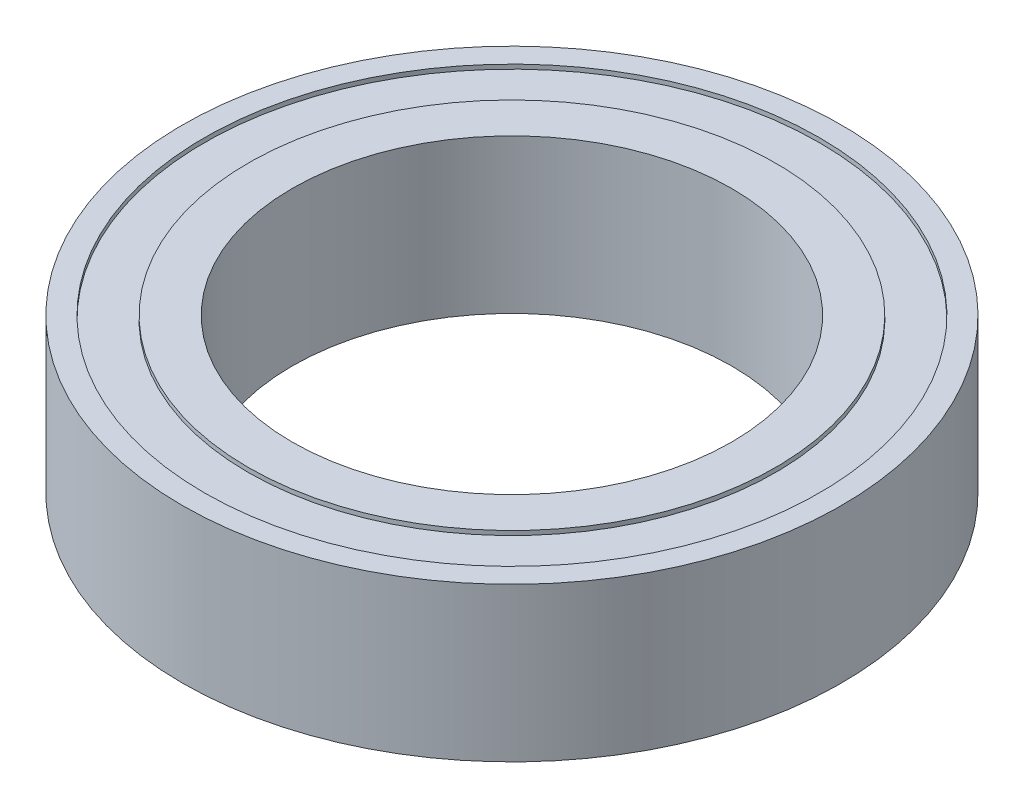
ISO-10303-21;
HEADER;
FILE_DESCRIPTION(('STEP AP214'),'2;1');
FILE_NAME('part.step','',(''),(''),'','','');
FILE_SCHEMA(('AUTOMOTIVE_DESIGN { 1 0 10303 214 1 1 1 1 }'));
ENDSEC;
DATA;
#1=APPLICATION_CONTEXT('core data for automotive mechanical design processes');
#2=APPLICATION_PROTOCOL_DEFINITION('international standard','automotive_design',2000,#1);
#3=PRODUCT_CONTEXT('',#1,'mechanical');
#4=PRODUCT('Part','Part','',(#3));
#5=PRODUCT_RELATED_PRODUCT_CATEGORY('part','',(#4));
#6=PRODUCT_DEFINITION_FORMATION('','',#4);
#7=PRODUCT_DEFINITION_CONTEXT('part definition',#1,'design');
#8=PRODUCT_DEFINITION('design','',#6,#7);
#9=PRODUCT_DEFINITION_SHAPE('','',#8);
#10=(LENGTH_UNIT() NAMED_UNIT(*) SI_UNIT(.MILLI.,.METRE.));
#11=(NAMED_UNIT(*) PLANE_ANGLE_UNIT() SI_UNIT($,.RADIAN.));
#12=(NAMED_UNIT(*) SI_UNIT($,.STERADIAN.) SOLID_ANGLE_UNIT());
#13=UNCERTAINTY_MEASURE_WITH_UNIT(LENGTH_MEASURE(1.E-05),#10,'distance_accuracy_value','');
#14=(GEOMETRIC_REPRESENTATION_CONTEXT(3) GLOBAL_UNCERTAINTY_ASSIGNED_CONTEXT((#13)) GLOBAL_UNIT_ASSIGNED_CONTEXT((#10,
#11,#12)) REPRESENTATION_CONTEXT('',''));
#15=CARTESIAN_POINT('',(0.,0.,0.));
#16=DIRECTION('',(0.,0.,1.));
#17=DIRECTION('',(1.,0.,0.));
#18=AXIS2_PLACEMENT_3D('',#15,#16,#17);
#19=CARTESIAN_POINT('',(0.,3.5,0.));
#20=DIRECTION('',(0.,-1.,0.));
#21=DIRECTION('',(0.,0.,-1.));
#22=AXIS2_PLACEMENT_3D('',#19,#20,#21);
#23=CYLINDRICAL_SURFACE('',#22,7.);
#24=CARTESIAN_POINT('',(0.,0.,0.));
#25=DIRECTION('',(0.,1.,0.));
#26=DIRECTION('',(0.,0.,1.));
#27=AXIS2_PLACEMENT_3D('',#24,#25,#26);
#28=CIRCLE('',#27,7.);
#29=CARTESIAN_POINT('',(0.,0.,7.));
#30=VERTEX_POINT('',#29);
#31=EDGE_CURVE('E50',#30,#30,#28,.T.);
#32=ORIENTED_EDGE('',*,*,#31,.F.);
#33=EDGE_LOOP('',(#32));
#34=FACE_BOUND('',#33,.T.);
#35=CARTESIAN_POINT('',(0.,0.1,0.));
#36=DIRECTION('',(0.,1.,0.));
#37=DIRECTION('',(0.,0.,1.));
#38=AXIS2_PLACEMENT_3D('',#35,#36,#37);
#39=CIRCLE('',#38,7.);
#40=CARTESIAN_POINT('',(0.,0.1,7.));
#41=VERTEX_POINT('',#40);
#42=EDGE_CURVE('E53',#41,#41,#39,.T.);
#43=ORIENTED_EDGE('',*,*,#42,.T.);
#44=EDGE_LOOP('',(#43));
#45=FACE_BOUND('',#44,.T.);
#46=ADVANCED_FACE('F32',(#34,#45),#23,.F.);
#47=CARTESIAN_POINT('',(0.,3.5,0.));
#48=DIRECTION('',(0.,1.,0.));
#49=DIRECTION('',(0.,0.,1.));
#50=AXIS2_PLACEMENT_3D('',#47,#48,#49);
#51=PLANE('',#50);
#52=CARTESIAN_POINT('',(0.,3.5,0.));
#53=DIRECTION('',(0.,1.,0.));
#54=DIRECTION('',(0.,0.,1.));
#55=AXIS2_PLACEMENT_3D('',#52,#53,#54);
#56=CIRCLE('',#55,7.5);
#57=CARTESIAN_POINT('',(0.,3.5,7.5));
#58=VERTEX_POINT('',#57);
#59=EDGE_CURVE('E39',#58,#58,#56,.T.);
#60=ORIENTED_EDGE('',*,*,#59,.T.);
#61=EDGE_LOOP('',(#60));
#62=FACE_BOUND('',#61,.T.);
#63=CARTESIAN_POINT('',(0.,3.5,0.));
#64=DIRECTION('',(0.,1.,0.));
#65=DIRECTION('',(0.,0.,1.));
#66=AXIS2_PLACEMENT_3D('',#63,#64,#65);
#67=CIRCLE('',#66,7.);
#68=CARTESIAN_POINT('',(0.,3.5,7.));
#69=VERTEX_POINT('',#68);
#70=EDGE_CURVE('E48',#69,#69,#67,.T.);
#71=ORIENTED_EDGE('',*,*,#70,.F.);
#72=EDGE_LOOP('',(#71));
#73=FACE_BOUND('',#72,.T.);
#74=ADVANCED_FACE('F98',(#62,#73),#51,.T.);
#75=CARTESIAN_POINT('',(0.,0.,0.));
#76=DIRECTION('',(0.,1.,0.));
#77=DIRECTION('',(0.,0.,1.));
#78=AXIS2_PLACEMENT_3D('',#75,#76,#77);
#79=PLANE('',#78);
#80=CARTESIAN_POINT('',(0.,0.,0.));
#81=DIRECTION('',(0.,1.,0.));
#82=DIRECTION('',(0.,0.,1.));
#83=AXIS2_PLACEMENT_3D('',#80,#81,#82);
#84=CIRCLE('',#83,7.5);
#85=CARTESIAN_POINT('',(0.,0.,7.5));
#86=VERTEX_POINT('',#85);
#87=EDGE_CURVE('E43',#86,#86,#84,.T.);
#88=ORIENTED_EDGE('',*,*,#87,.F.);
#89=EDGE_LOOP('',(#88));
#90=FACE_BOUND('',#89,.T.);
#91=ORIENTED_EDGE('',*,*,#31,.T.);
#92=EDGE_LOOP('',(#91));
#93=FACE_BOUND('',#92,.T.);
#94=ADVANCED_FACE('F105',(#90,#93),#79,.F.);
#95=CARTESIAN_POINT('',(0.,3.5,0.));
#96=DIRECTION('',(0.,-1.,0.));
#97=DIRECTION('',(0.,0.,-1.));
#98=AXIS2_PLACEMENT_3D('',#95,#96,#97);
#99=CYLINDRICAL_SURFACE('',#98,7.5);
#100=ORIENTED_EDGE('',*,*,#59,.F.);
#101=EDGE_LOOP('',(#100));
#102=FACE_BOUND('',#101,.T.);
#103=ORIENTED_EDGE('',*,*,#87,.T.);
#104=EDGE_LOOP('',(#103));
#105=FACE_BOUND('',#104,.T.);
#106=ADVANCED_FACE('F34',(#102,#105),#99,.T.);
#107=CARTESIAN_POINT('',(0.,3.4,0.));
#108=DIRECTION('',(0.,1.,0.));
#109=DIRECTION('',(0.,0.,1.));
#110=AXIS2_PLACEMENT_3D('',#107,#108,#109);
#111=CIRCLE('',#110,7.);
#112=CARTESIAN_POINT('',(0.,3.4,7.));
#113=VERTEX_POINT('',#112);
#114=EDGE_CURVE('E10',#113,#113,#111,.T.);
#115=ORIENTED_EDGE('',*,*,#114,.F.);
#116=EDGE_LOOP('',(#115));
#117=FACE_BOUND('',#116,.T.);
#118=ORIENTED_EDGE('',*,*,#70,.T.);
#119=EDGE_LOOP('',(#118));
#120=FACE_BOUND('',#119,.T.);
#121=ADVANCED_FACE('F101',(#117,#120),#23,.F.);
#122=CARTESIAN_POINT('',(0.,3.4,0.));
#123=DIRECTION('',(0.,1.,0.));
#124=DIRECTION('',(0.,0.,1.));
#125=AXIS2_PLACEMENT_3D('',#122,#123,#124);
#126=PLANE('',#125);
#127=ORIENTED_EDGE('',*,*,#114,.T.);
#128=EDGE_LOOP('',(#127));
#129=FACE_BOUND('',#128,.T.);
#130=CARTESIAN_POINT('',(0.,3.4,0.));
#131=DIRECTION('',(0.,1.,0.));
#132=DIRECTION('',(0.,0.,1.));
#133=AXIS2_PLACEMENT_3D('',#130,#131,#132);
#134=CIRCLE('',#133,6.);
#135=CARTESIAN_POINT('',(0.,3.4,6.));
#136=VERTEX_POINT('',#135);
#137=EDGE_CURVE('E58',#136,#136,#134,.T.);
#138=ORIENTED_EDGE('',*,*,#137,.F.);
#139=EDGE_LOOP('',(#138));
#140=FACE_BOUND('',#139,.T.);
#141=ADVANCED_FACE('F111',(#129,#140),#126,.T.);
#142=CARTESIAN_POINT('',(0.,0.1,0.));
#143=DIRECTION('',(0.,1.,0.));
#144=DIRECTION('',(0.,0.,1.));
#145=AXIS2_PLACEMENT_3D('',#142,#143,#144);
#146=PLANE('',#145);
#147=ORIENTED_EDGE('',*,*,#42,.F.);
#148=EDGE_LOOP('',(#147));
#149=FACE_BOUND('',#148,.T.);
#150=CARTESIAN_POINT('',(0.,0.0999999999999998,0.));
#151=DIRECTION('',(0.,1.,0.));
#152=DIRECTION('',(0.,0.,1.));
#153=AXIS2_PLACEMENT_3D('',#150,#151,#152);
#154=CIRCLE('',#153,6.);
#155=CARTESIAN_POINT('',(0.,0.0999999999999998,6.));
#156=VERTEX_POINT('',#155);
#157=EDGE_CURVE('E61',#156,#156,#154,.F.);
#158=ORIENTED_EDGE('',*,*,#157,.F.);
#159=EDGE_LOOP('',(#158));
#160=FACE_BOUND('',#159,.T.);
#161=ADVANCED_FACE('F93',(#149,#160),#146,.F.);
#162=CARTESIAN_POINT('',(0.,3.5,0.));
#163=DIRECTION('',(0.,-1.,0.));
#164=DIRECTION('',(0.,0.,-1.));
#165=AXIS2_PLACEMENT_3D('',#162,#163,#164);
#166=CYLINDRICAL_SURFACE('',#165,6.);
#167=CARTESIAN_POINT('',(0.,0.,0.));
#168=DIRECTION('',(0.,1.,0.));
#169=DIRECTION('',(0.,0.,1.));
#170=AXIS2_PLACEMENT_3D('',#167,#168,#169);
#171=CIRCLE('',#170,6.);
#172=CARTESIAN_POINT('',(0.,0.,6.));
#173=VERTEX_POINT('',#172);
#174=EDGE_CURVE('E65',#173,#173,#171,.T.);
#175=ORIENTED_EDGE('',*,*,#174,.T.);
#176=EDGE_LOOP('',(#175));
#177=FACE_BOUND('',#176,.T.);
#178=ORIENTED_EDGE('',*,*,#157,.T.);
#179=EDGE_LOOP('',(#178));
#180=FACE_BOUND('',#179,.T.);
#181=ADVANCED_FACE('F83',(#177,#180),#166,.T.);
#182=CARTESIAN_POINT('',(0.,3.5,0.));
#183=DIRECTION('',(0.,1.,0.));
#184=DIRECTION('',(0.,0.,1.));
#185=AXIS2_PLACEMENT_3D('',#182,#183,#184);
#186=PLANE('',#185);
#187=CARTESIAN_POINT('',(0.,3.5,0.));
#188=DIRECTION('',(0.,1.,0.));
#189=DIRECTION('',(0.,0.,1.));
#190=AXIS2_PLACEMENT_3D('',#187,#188,#189);
#191=CIRCLE('',#190,6.);
#192=CARTESIAN_POINT('',(0.,3.5,6.));
#193=VERTEX_POINT('',#192);
#194=EDGE_CURVE('E64',#193,#193,#191,.T.);
#195=ORIENTED_EDGE('',*,*,#194,.T.);
#196=EDGE_LOOP('',(#195));
#197=FACE_BOUND('',#196,.T.);
#198=CARTESIAN_POINT('',(0.,3.5,0.));
#199=DIRECTION('',(0.,1.,0.));
#200=DIRECTION('',(0.,0.,1.));
#201=AXIS2_PLACEMENT_3D('',#198,#199,#200);
#202=CIRCLE('',#201,5.);
#203=CARTESIAN_POINT('',(0.,3.5,5.));
#204=VERTEX_POINT('',#203);
#205=EDGE_CURVE('E68',#204,#204,#202,.T.);
#206=ORIENTED_EDGE('',*,*,#205,.F.);
#207=EDGE_LOOP('',(#206));
#208=FACE_BOUND('',#207,.T.);
#209=ADVANCED_FACE('F80',(#197,#208),#186,.T.);
#210=CARTESIAN_POINT('',(0.,0.,0.));
#211=DIRECTION('',(0.,1.,0.));
#212=DIRECTION('',(0.,0.,1.));
#213=AXIS2_PLACEMENT_3D('',#210,#211,#212);
#214=PLANE('',#213);
#215=ORIENTED_EDGE('',*,*,#174,.F.);
#216=EDGE_LOOP('',(#215));
#217=FACE_BOUND('',#216,.T.);
#218=CARTESIAN_POINT('',(0.,0.,0.));
#219=DIRECTION('',(0.,1.,0.));
#220=DIRECTION('',(0.,0.,1.));
#221=AXIS2_PLACEMENT_3D('',#218,#219,#220);
#222=CIRCLE('',#221,5.);
#223=CARTESIAN_POINT('',(0.,0.,5.));
#224=VERTEX_POINT('',#223);
#225=EDGE_CURVE('E71',#224,#224,#222,.T.);
#226=ORIENTED_EDGE('',*,*,#225,.T.);
#227=EDGE_LOOP('',(#226));
#228=FACE_BOUND('',#227,.T.);
#229=ADVANCED_FACE('F82',(#217,#228),#214,.F.);
#230=ORIENTED_EDGE('',*,*,#137,.T.);
#231=EDGE_LOOP('',(#230));
#232=FACE_BOUND('',#231,.T.);
#233=ORIENTED_EDGE('',*,*,#194,.F.);
#234=EDGE_LOOP('',(#233));
#235=FACE_BOUND('',#234,.T.);
#236=ADVANCED_FACE('F90',(#232,#235),#166,.T.);
#237=CARTESIAN_POINT('',(0.,3.5,0.));
#238=DIRECTION('',(0.,-1.,0.));
#239=DIRECTION('',(0.,0.,-1.));
#240=AXIS2_PLACEMENT_3D('',#237,#238,#239);
#241=CYLINDRICAL_SURFACE('',#240,5.);
#242=ORIENTED_EDGE('',*,*,#205,.T.);
#243=EDGE_LOOP('',(#242));
#244=FACE_BOUND('',#243,.T.);
#245=ORIENTED_EDGE('',*,*,#225,.F.);
#246=EDGE_LOOP('',(#245));
#247=FACE_BOUND('',#246,.T.);
#248=ADVANCED_FACE('F77',(#244,#247),#241,.F.);
#249=CLOSED_SHELL('',(#46,#74,#94,#106,#121,#141,#161,#181,#209,#229,#236,#248));
#250=MANIFOLD_SOLID_BREP('B2',#249);
#251=ADVANCED_BREP_SHAPE_REPRESENTATION('',(#18,#250),#14);
#252=SHAPE_DEFINITION_REPRESENTATION(#9,#251);
ENDSEC;
END-ISO-10303-21;
